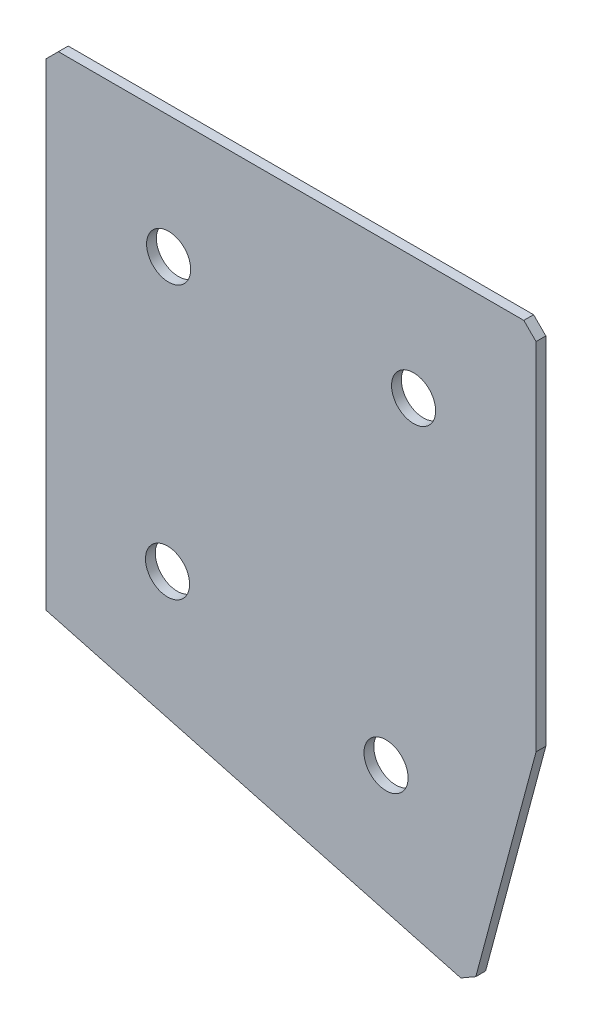
ISO-10303-21;
HEADER;
FILE_DESCRIPTION(('STEP AP214'),'2;1');
FILE_NAME('part.step','',(''),(''),'','','');
FILE_SCHEMA(('AUTOMOTIVE_DESIGN { 1 0 10303 214 1 1 1 1 }'));
ENDSEC;
DATA;
#1=APPLICATION_CONTEXT('core data for automotive mechanical design processes');
#2=APPLICATION_PROTOCOL_DEFINITION('international standard','automotive_design',2000,#1);
#3=PRODUCT_CONTEXT('',#1,'mechanical');
#4=PRODUCT('Part','Part','',(#3));
#5=PRODUCT_RELATED_PRODUCT_CATEGORY('part','',(#4));
#6=PRODUCT_DEFINITION_FORMATION('','',#4);
#7=PRODUCT_DEFINITION_CONTEXT('part definition',#1,'design');
#8=PRODUCT_DEFINITION('design','',#6,#7);
#9=PRODUCT_DEFINITION_SHAPE('','',#8);
#10=(LENGTH_UNIT() NAMED_UNIT(*) SI_UNIT(.MILLI.,.METRE.));
#11=(NAMED_UNIT(*) PLANE_ANGLE_UNIT() SI_UNIT($,.RADIAN.));
#12=(NAMED_UNIT(*) SI_UNIT($,.STERADIAN.) SOLID_ANGLE_UNIT());
#13=UNCERTAINTY_MEASURE_WITH_UNIT(LENGTH_MEASURE(1.E-05),#10,'distance_accuracy_value','');
#14=(GEOMETRIC_REPRESENTATION_CONTEXT(3) GLOBAL_UNCERTAINTY_ASSIGNED_CONTEXT((#13)) GLOBAL_UNIT_ASSIGNED_CONTEXT((#10,
#11,#12)) REPRESENTATION_CONTEXT('',''));
#15=CARTESIAN_POINT('',(0.,0.,0.));
#16=DIRECTION('',(0.,0.,1.));
#17=DIRECTION('',(1.,0.,0.));
#18=AXIS2_PLACEMENT_3D('',#15,#16,#17);
#19=CARTESIAN_POINT('',(0.,0.,-2.));
#20=DIRECTION('',(1.,0.,0.));
#21=DIRECTION('',(0.,0.,-1.));
#22=AXIS2_PLACEMENT_3D('',#19,#20,#21);
#23=PLANE('',#22);
#24=DIRECTION('',(0.,1.,0.));
#25=VECTOR('',#24,1.);
#26=CARTESIAN_POINT('',(0.,0.,0.));
#27=LINE('',#26,#25);
#28=CARTESIAN_POINT('',(0.,-100.,0.));
#29=VERTEX_POINT('',#28);
#30=CARTESIAN_POINT('',(0.,-2.5,0.));
#31=VERTEX_POINT('',#30);
#32=EDGE_CURVE('E137',#29,#31,#27,.T.);
#33=ORIENTED_EDGE('',*,*,#32,.T.);
#34=DIRECTION('',(0.,0.,-1.));
#35=VECTOR('',#34,1.);
#36=CARTESIAN_POINT('',(0.,-2.5,-2.));
#37=LINE('',#36,#35);
#38=CARTESIAN_POINT('',(0.,-2.5,-2.));
#39=VERTEX_POINT('',#38);
#40=EDGE_CURVE('E11',#31,#39,#37,.T.);
#41=ORIENTED_EDGE('',*,*,#40,.T.);
#42=DIRECTION('',(0.,1.,0.));
#43=VECTOR('',#42,1.);
#44=CARTESIAN_POINT('',(0.,0.,-2.));
#45=LINE('',#44,#43);
#46=CARTESIAN_POINT('',(0.,-100.,-2.));
#47=VERTEX_POINT('',#46);
#48=EDGE_CURVE('E153',#47,#39,#45,.T.);
#49=ORIENTED_EDGE('',*,*,#48,.F.);
#50=DIRECTION('',(0.,0.,1.));
#51=VECTOR('',#50,1.);
#52=CARTESIAN_POINT('',(0.,-100.,-2.));
#53=LINE('',#52,#51);
#54=EDGE_CURVE('E125',#47,#29,#53,.T.);
#55=ORIENTED_EDGE('',*,*,#54,.T.);
#56=EDGE_LOOP('',(#33,#41,#49,#55));
#57=FACE_BOUND('',#56,.T.);
#58=ADVANCED_FACE('F39',(#57),#23,.F.);
#59=CARTESIAN_POINT('',(0.,0.,-2.));
#60=DIRECTION('',(0.,-1.,0.));
#61=DIRECTION('',(0.,0.,-1.));
#62=AXIS2_PLACEMENT_3D('',#59,#60,#61);
#63=PLANE('',#62);
#64=DIRECTION('',(1.,0.,0.));
#65=VECTOR('',#64,1.);
#66=CARTESIAN_POINT('',(0.,0.,0.));
#67=LINE('',#66,#65);
#68=CARTESIAN_POINT('',(2.5,0.,0.));
#69=VERTEX_POINT('',#68);
#70=CARTESIAN_POINT('',(97.5,0.,0.));
#71=VERTEX_POINT('',#70);
#72=EDGE_CURVE('E141',#69,#71,#67,.T.);
#73=ORIENTED_EDGE('',*,*,#72,.T.);
#74=DIRECTION('',(0.,0.,-1.));
#75=VECTOR('',#74,1.);
#76=CARTESIAN_POINT('',(97.5,0.,-2.));
#77=LINE('',#76,#75);
#78=CARTESIAN_POINT('',(97.5,0.,-2.));
#79=VERTEX_POINT('',#78);
#80=EDGE_CURVE('E48',#71,#79,#77,.T.);
#81=ORIENTED_EDGE('',*,*,#80,.T.);
#82=DIRECTION('',(1.,0.,0.));
#83=VECTOR('',#82,1.);
#84=CARTESIAN_POINT('',(0.,0.,-2.));
#85=LINE('',#84,#83);
#86=CARTESIAN_POINT('',(2.5,0.,-2.));
#87=VERTEX_POINT('',#86);
#88=EDGE_CURVE('E113',#87,#79,#85,.T.);
#89=ORIENTED_EDGE('',*,*,#88,.F.);
#90=DIRECTION('',(0.,0.,1.));
#91=VECTOR('',#90,1.);
#92=CARTESIAN_POINT('',(2.5,0.,-2.));
#93=LINE('',#92,#91);
#94=EDGE_CURVE('E182',#87,#69,#93,.T.);
#95=ORIENTED_EDGE('',*,*,#94,.T.);
#96=EDGE_LOOP('',(#73,#81,#89,#95));
#97=FACE_BOUND('',#96,.T.);
#98=ADVANCED_FACE('F188',(#97),#63,.F.);
#99=CARTESIAN_POINT('',(100.,0.,-2.));
#100=DIRECTION('',(-1.,0.,0.));
#101=DIRECTION('',(0.,0.,1.));
#102=AXIS2_PLACEMENT_3D('',#99,#100,#101);
#103=PLANE('',#102);
#104=DIRECTION('',(0.,-1.,0.));
#105=VECTOR('',#104,1.);
#106=CARTESIAN_POINT('',(100.,0.,-2.));
#107=LINE('',#106,#105);
#108=CARTESIAN_POINT('',(100.,-2.50000000000003,-2.));
#109=VERTEX_POINT('',#108);
#110=CARTESIAN_POINT('',(100.,-75.0311102226082,-2.));
#111=VERTEX_POINT('',#110);
#112=EDGE_CURVE('E103',#109,#111,#107,.T.);
#113=ORIENTED_EDGE('',*,*,#112,.F.);
#114=DIRECTION('',(0.,0.,1.));
#115=VECTOR('',#114,1.);
#116=CARTESIAN_POINT('',(100.,-2.50000000000003,-2.));
#117=LINE('',#116,#115);
#118=CARTESIAN_POINT('',(100.,-2.50000000000003,0.));
#119=VERTEX_POINT('',#118);
#120=EDGE_CURVE('E179',#109,#119,#117,.T.);
#121=ORIENTED_EDGE('',*,*,#120,.T.);
#122=DIRECTION('',(0.,-1.,0.));
#123=VECTOR('',#122,1.);
#124=CARTESIAN_POINT('',(100.,0.,0.));
#125=LINE('',#124,#123);
#126=CARTESIAN_POINT('',(100.,-75.0311102226082,0.));
#127=VERTEX_POINT('',#126);
#128=EDGE_CURVE('E119',#119,#127,#125,.T.);
#129=ORIENTED_EDGE('',*,*,#128,.T.);
#130=DIRECTION('',(0.,0.,1.));
#131=VECTOR('',#130,1.);
#132=CARTESIAN_POINT('',(100.,-75.0311102226082,-2.));
#133=LINE('',#132,#131);
#134=EDGE_CURVE('E116',#111,#127,#133,.T.);
#135=ORIENTED_EDGE('',*,*,#134,.F.);
#136=EDGE_LOOP('',(#113,#121,#129,#135));
#137=FACE_BOUND('',#136,.T.);
#138=ADVANCED_FACE('F117',(#137),#103,.F.);
#139=CARTESIAN_POINT('',(87.0590477448739,-123.327401537062,-2.));
#140=DIRECTION('',(-0.965925826289068,0.258819045102521,0.));
#141=DIRECTION('',(-0.258819045102521,-0.965925826289068,0.));
#142=AXIS2_PLACEMENT_3D('',#139,#140,#141);
#143=PLANE('',#142);
#144=DIRECTION('',(-0.258819045102521,-0.965925826289068,0.));
#145=VECTOR('',#144,1.);
#146=CARTESIAN_POINT('',(87.0590477448739,-123.327401537062,0.));
#147=LINE('',#146,#145);
#148=CARTESIAN_POINT('',(87.7060953576302,-120.912586971339,0.));
#149=VERTEX_POINT('',#148);
#150=EDGE_CURVE('E147',#127,#149,#147,.T.);
#151=ORIENTED_EDGE('',*,*,#150,.T.);
#152=DIRECTION('',(0.,0.,-1.));
#153=VECTOR('',#152,1.);
#154=CARTESIAN_POINT('',(87.7060953576302,-120.912586971339,-2.));
#155=LINE('',#154,#153);
#156=CARTESIAN_POINT('',(87.7060953576302,-120.912586971339,-2.));
#157=VERTEX_POINT('',#156);
#158=EDGE_CURVE('E129',#149,#157,#155,.T.);
#159=ORIENTED_EDGE('',*,*,#158,.T.);
#160=DIRECTION('',(-0.258819045102521,-0.965925826289068,0.));
#161=VECTOR('',#160,1.);
#162=CARTESIAN_POINT('',(87.0590477448739,-123.327401537062,-2.));
#163=LINE('',#162,#161);
#164=EDGE_CURVE('E107',#111,#157,#163,.T.);
#165=ORIENTED_EDGE('',*,*,#164,.F.);
#166=ORIENTED_EDGE('',*,*,#134,.T.);
#167=EDGE_LOOP('',(#151,#159,#165,#166));
#168=FACE_BOUND('',#167,.T.);
#169=ADVANCED_FACE('F127',(#168),#143,.F.);
#170=CARTESIAN_POINT('',(0.,-100.,-2.));
#171=DIRECTION('',(0.258819045102521,0.965925826289068,0.));
#172=DIRECTION('',(-0.965925826289068,0.258819045102521,0.));
#173=AXIS2_PLACEMENT_3D('',#170,#171,#172);
#174=PLANE('',#173);
#175=DIRECTION('',(-0.965925826289068,0.258819045102521,0.));
#176=VECTOR('',#175,1.);
#177=CARTESIAN_POINT('',(0.,-100.,-2.));
#178=LINE('',#177,#176);
#179=CARTESIAN_POINT('',(84.6442331791512,-122.680353924305,-2.));
#180=VERTEX_POINT('',#179);
#181=EDGE_CURVE('E131',#180,#47,#178,.T.);
#182=ORIENTED_EDGE('',*,*,#181,.F.);
#183=DIRECTION('',(0.,0.,1.));
#184=VECTOR('',#183,1.);
#185=CARTESIAN_POINT('',(84.6442331791512,-122.680353924305,-2.));
#186=LINE('',#185,#184);
#187=CARTESIAN_POINT('',(84.6442331791512,-122.680353924305,0.));
#188=VERTEX_POINT('',#187);
#189=EDGE_CURVE('E124',#180,#188,#186,.T.);
#190=ORIENTED_EDGE('',*,*,#189,.T.);
#191=DIRECTION('',(-0.965925826289068,0.258819045102521,0.));
#192=VECTOR('',#191,1.);
#193=CARTESIAN_POINT('',(0.,-100.,0.));
#194=LINE('',#193,#192);
#195=EDGE_CURVE('E150',#188,#29,#194,.T.);
#196=ORIENTED_EDGE('',*,*,#195,.T.);
#197=ORIENTED_EDGE('',*,*,#54,.F.);
#198=EDGE_LOOP('',(#182,#190,#196,#197));
#199=FACE_BOUND('',#198,.T.);
#200=ADVANCED_FACE('F218',(#199),#174,.F.);
#201=CARTESIAN_POINT('',(0.,0.,-2.));
#202=DIRECTION('',(0.,0.,1.));
#203=DIRECTION('',(1.,0.,0.));
#204=AXIS2_PLACEMENT_3D('',#201,#202,#203);
#205=PLANE('',#204);
#206=CARTESIAN_POINT('',(24.7762464008849,-80.7568707043396,-2.));
#207=DIRECTION('',(0.,0.,-1.));
#208=DIRECTION('',(0.,1.,0.));
#209=AXIS2_PLACEMENT_3D('',#206,#207,#208);
#210=CIRCLE('',#209,4.5);
#211=CARTESIAN_POINT('',(24.7762464008849,-76.2568707043396,-2.));
#212=VERTEX_POINT('',#211);
#213=EDGE_CURVE('E250',#212,#212,#210,.T.);
#214=ORIENTED_EDGE('',*,*,#213,.F.);
#215=EDGE_LOOP('',(#214));
#216=FACE_BOUND('',#215,.T.);
#217=CARTESIAN_POINT('',(69.3813782152103,-92.7087797522719,-2.00000000000001));
#218=DIRECTION('',(0.,0.,-1.));
#219=DIRECTION('',(0.,1.,0.));
#220=AXIS2_PLACEMENT_3D('',#217,#218,#219);
#221=CIRCLE('',#220,4.5);
#222=CARTESIAN_POINT('',(69.3813782152103,-88.2087797522719,-2.00000000000001));
#223=VERTEX_POINT('',#222);
#224=EDGE_CURVE('E254',#223,#223,#221,.T.);
#225=ORIENTED_EDGE('',*,*,#224,.F.);
#226=EDGE_LOOP('',(#225));
#227=FACE_BOUND('',#226,.T.);
#228=CARTESIAN_POINT('',(25.,-25.,-2.));
#229=DIRECTION('',(0.,0.,-1.));
#230=DIRECTION('',(0.,1.,0.));
#231=AXIS2_PLACEMENT_3D('',#228,#229,#230);
#232=CIRCLE('',#231,4.5);
#233=CARTESIAN_POINT('',(25.,-20.5,-2.));
#234=VERTEX_POINT('',#233);
#235=EDGE_CURVE('E264',#234,#234,#232,.T.);
#236=ORIENTED_EDGE('',*,*,#235,.F.);
#237=EDGE_LOOP('',(#236));
#238=FACE_BOUND('',#237,.T.);
#239=CARTESIAN_POINT('',(75.,-25.,-2.));
#240=DIRECTION('',(0.,0.,-1.));
#241=DIRECTION('',(0.,1.,0.));
#242=AXIS2_PLACEMENT_3D('',#239,#240,#241);
#243=CIRCLE('',#242,4.5);
#244=CARTESIAN_POINT('',(75.,-20.5,-2.));
#245=VERTEX_POINT('',#244);
#246=EDGE_CURVE('E272',#245,#245,#243,.T.);
#247=ORIENTED_EDGE('',*,*,#246,.F.);
#248=EDGE_LOOP('',(#247));
#249=FACE_BOUND('',#248,.T.);
#250=ORIENTED_EDGE('',*,*,#164,.T.);
#251=DIRECTION('',(0.866025403784439,0.5,0.));
#252=VECTOR('',#251,1.);
#253=CARTESIAN_POINT('',(84.6442331791512,-122.680353924305,-2.));
#254=LINE('',#253,#252);
#255=EDGE_CURVE('E176',#157,#180,#254,.F.);
#256=ORIENTED_EDGE('',*,*,#255,.T.);
#257=ORIENTED_EDGE('',*,*,#181,.T.);
#258=ORIENTED_EDGE('',*,*,#48,.T.);
#259=DIRECTION('',(-0.707106781186548,-0.707106781186548,0.));
#260=VECTOR('',#259,1.);
#261=CARTESIAN_POINT('',(2.5,0.,-2.));
#262=LINE('',#261,#260);
#263=EDGE_CURVE('E171',#39,#87,#262,.F.);
#264=ORIENTED_EDGE('',*,*,#263,.T.);
#265=ORIENTED_EDGE('',*,*,#88,.T.);
#266=DIRECTION('',(-0.707106781186548,0.707106781186548,0.));
#267=VECTOR('',#266,1.);
#268=CARTESIAN_POINT('',(100.,-2.50000000000003,-2.));
#269=LINE('',#268,#267);
#270=EDGE_CURVE('E55',#79,#109,#269,.F.);
#271=ORIENTED_EDGE('',*,*,#270,.T.);
#272=ORIENTED_EDGE('',*,*,#112,.T.);
#273=EDGE_LOOP('',(#250,#256,#257,#258,#264,#265,#271,#272));
#274=FACE_BOUND('',#273,.T.);
#275=ADVANCED_FACE('F105',(#216,#227,#238,#249,#274),#205,.F.);
#276=CARTESIAN_POINT('',(0.,0.,0.));
#277=DIRECTION('',(0.,0.,1.));
#278=DIRECTION('',(1.,0.,0.));
#279=AXIS2_PLACEMENT_3D('',#276,#277,#278);
#280=PLANE('',#279);
#281=CARTESIAN_POINT('',(24.7762464008849,-80.7568707043396,0.));
#282=DIRECTION('',(0.,0.,-1.));
#283=DIRECTION('',(0.,1.,0.));
#284=AXIS2_PLACEMENT_3D('',#281,#282,#283);
#285=CIRCLE('',#284,4.5);
#286=CARTESIAN_POINT('',(24.7762464008849,-76.2568707043396,0.));
#287=VERTEX_POINT('',#286);
#288=EDGE_CURVE('E247',#287,#287,#285,.T.);
#289=ORIENTED_EDGE('',*,*,#288,.T.);
#290=EDGE_LOOP('',(#289));
#291=FACE_BOUND('',#290,.T.);
#292=CARTESIAN_POINT('',(69.3813782152103,-92.7087797522719,0.));
#293=DIRECTION('',(0.,0.,-1.));
#294=DIRECTION('',(0.,1.,0.));
#295=AXIS2_PLACEMENT_3D('',#292,#293,#294);
#296=CIRCLE('',#295,4.5);
#297=CARTESIAN_POINT('',(69.3813782152103,-88.2087797522719,0.));
#298=VERTEX_POINT('',#297);
#299=EDGE_CURVE('E260',#298,#298,#296,.T.);
#300=ORIENTED_EDGE('',*,*,#299,.T.);
#301=EDGE_LOOP('',(#300));
#302=FACE_BOUND('',#301,.T.);
#303=CARTESIAN_POINT('',(25.,-25.,0.));
#304=DIRECTION('',(0.,0.,-1.));
#305=DIRECTION('',(0.,1.,0.));
#306=AXIS2_PLACEMENT_3D('',#303,#304,#305);
#307=CIRCLE('',#306,4.5);
#308=CARTESIAN_POINT('',(25.,-20.5,0.));
#309=VERTEX_POINT('',#308);
#310=EDGE_CURVE('E268',#309,#309,#307,.T.);
#311=ORIENTED_EDGE('',*,*,#310,.T.);
#312=EDGE_LOOP('',(#311));
#313=FACE_BOUND('',#312,.T.);
#314=CARTESIAN_POINT('',(75.,-25.,0.));
#315=DIRECTION('',(0.,0.,-1.));
#316=DIRECTION('',(0.,1.,0.));
#317=AXIS2_PLACEMENT_3D('',#314,#315,#316);
#318=CIRCLE('',#317,4.5);
#319=CARTESIAN_POINT('',(75.,-20.5,0.));
#320=VERTEX_POINT('',#319);
#321=EDGE_CURVE('E142',#320,#320,#318,.T.);
#322=ORIENTED_EDGE('',*,*,#321,.T.);
#323=EDGE_LOOP('',(#322));
#324=FACE_BOUND('',#323,.T.);
#325=ORIENTED_EDGE('',*,*,#195,.F.);
#326=DIRECTION('',(-0.866025403784439,-0.5,0.));
#327=VECTOR('',#326,1.);
#328=CARTESIAN_POINT('',(74.283209816645,-128.662293551728,0.));
#329=LINE('',#328,#327);
#330=EDGE_CURVE('E166',#188,#149,#329,.F.);
#331=ORIENTED_EDGE('',*,*,#330,.T.);
#332=ORIENTED_EDGE('',*,*,#150,.F.);
#333=ORIENTED_EDGE('',*,*,#128,.F.);
#334=DIRECTION('',(0.707106781186548,-0.707106781186548,0.));
#335=VECTOR('',#334,1.);
#336=CARTESIAN_POINT('',(48.75,48.75,0.));
#337=LINE('',#336,#335);
#338=EDGE_CURVE('E163',#119,#71,#337,.F.);
#339=ORIENTED_EDGE('',*,*,#338,.T.);
#340=ORIENTED_EDGE('',*,*,#72,.F.);
#341=DIRECTION('',(0.707106781186548,0.707106781186548,0.));
#342=VECTOR('',#341,1.);
#343=CARTESIAN_POINT('',(1.25,-1.25,0.));
#344=LINE('',#343,#342);
#345=EDGE_CURVE('E160',#69,#31,#344,.F.);
#346=ORIENTED_EDGE('',*,*,#345,.T.);
#347=ORIENTED_EDGE('',*,*,#32,.F.);
#348=EDGE_LOOP('',(#325,#331,#332,#333,#339,#340,#346,#347));
#349=FACE_BOUND('',#348,.T.);
#350=ADVANCED_FACE('F193',(#291,#302,#313,#324,#349),#280,.T.);
#351=CARTESIAN_POINT('',(75.,-25.,-2.));
#352=DIRECTION('',(0.,0.,-1.));
#353=DIRECTION('',(0.,1.,0.));
#354=AXIS2_PLACEMENT_3D('',#351,#352,#353);
#355=CYLINDRICAL_SURFACE('',#354,4.5);
#356=ORIENTED_EDGE('',*,*,#321,.F.);
#357=EDGE_LOOP('',(#356));
#358=FACE_BOUND('',#357,.T.);
#359=ORIENTED_EDGE('',*,*,#246,.T.);
#360=EDGE_LOOP('',(#359));
#361=FACE_BOUND('',#360,.T.);
#362=ADVANCED_FACE('F224',(#358,#361),#355,.F.);
#363=CARTESIAN_POINT('',(25.,-25.,-2.));
#364=DIRECTION('',(0.,0.,-1.));
#365=DIRECTION('',(0.,1.,0.));
#366=AXIS2_PLACEMENT_3D('',#363,#364,#365);
#367=CYLINDRICAL_SURFACE('',#366,4.5);
#368=ORIENTED_EDGE('',*,*,#310,.F.);
#369=EDGE_LOOP('',(#368));
#370=FACE_BOUND('',#369,.T.);
#371=ORIENTED_EDGE('',*,*,#235,.T.);
#372=EDGE_LOOP('',(#371));
#373=FACE_BOUND('',#372,.T.);
#374=ADVANCED_FACE('F231',(#370,#373),#367,.F.);
#375=CARTESIAN_POINT('',(69.3813782152103,-92.7087797522719,-2.00000000000001));
#376=DIRECTION('',(0.,0.,-1.));
#377=DIRECTION('',(0.,1.,0.));
#378=AXIS2_PLACEMENT_3D('',#375,#376,#377);
#379=CYLINDRICAL_SURFACE('',#378,4.5);
#380=ORIENTED_EDGE('',*,*,#299,.F.);
#381=EDGE_LOOP('',(#380));
#382=FACE_BOUND('',#381,.T.);
#383=ORIENTED_EDGE('',*,*,#224,.T.);
#384=EDGE_LOOP('',(#383));
#385=FACE_BOUND('',#384,.T.);
#386=ADVANCED_FACE('F235',(#382,#385),#379,.F.);
#387=CARTESIAN_POINT('',(24.7762464008849,-80.7568707043396,-2.));
#388=DIRECTION('',(0.,0.,-1.));
#389=DIRECTION('',(0.,1.,0.));
#390=AXIS2_PLACEMENT_3D('',#387,#388,#389);
#391=CYLINDRICAL_SURFACE('',#390,4.5);
#392=ORIENTED_EDGE('',*,*,#288,.F.);
#393=EDGE_LOOP('',(#392));
#394=FACE_BOUND('',#393,.T.);
#395=ORIENTED_EDGE('',*,*,#213,.T.);
#396=EDGE_LOOP('',(#395));
#397=FACE_BOUND('',#396,.T.);
#398=ADVANCED_FACE('F203',(#394,#397),#391,.F.);
#399=CARTESIAN_POINT('',(84.6442331791512,-122.680353924305,-2.));
#400=DIRECTION('',(-0.5,0.866025403784439,0.));
#401=DIRECTION('',(0.,0.,1.));
#402=AXIS2_PLACEMENT_3D('',#399,#400,#401);
#403=PLANE('',#402);
#404=ORIENTED_EDGE('',*,*,#255,.F.);
#405=ORIENTED_EDGE('',*,*,#158,.F.);
#406=ORIENTED_EDGE('',*,*,#330,.F.);
#407=ORIENTED_EDGE('',*,*,#189,.F.);
#408=EDGE_LOOP('',(#404,#405,#406,#407));
#409=FACE_BOUND('',#408,.T.);
#410=ADVANCED_FACE('F198',(#409),#403,.F.);
#411=CARTESIAN_POINT('',(100.,-2.50000000000003,-2.));
#412=DIRECTION('',(-0.707106781186547,-0.707106781186547,0.));
#413=DIRECTION('',(0.,0.,1.));
#414=AXIS2_PLACEMENT_3D('',#411,#412,#413);
#415=PLANE('',#414);
#416=ORIENTED_EDGE('',*,*,#270,.F.);
#417=ORIENTED_EDGE('',*,*,#80,.F.);
#418=ORIENTED_EDGE('',*,*,#338,.F.);
#419=ORIENTED_EDGE('',*,*,#120,.F.);
#420=EDGE_LOOP('',(#416,#417,#418,#419));
#421=FACE_BOUND('',#420,.T.);
#422=ADVANCED_FACE('F196',(#421),#415,.F.);
#423=CARTESIAN_POINT('',(2.5,0.,-2.));
#424=DIRECTION('',(0.707106781186547,-0.707106781186547,0.));
#425=DIRECTION('',(0.,0.,1.));
#426=AXIS2_PLACEMENT_3D('',#423,#424,#425);
#427=PLANE('',#426);
#428=ORIENTED_EDGE('',*,*,#263,.F.);
#429=ORIENTED_EDGE('',*,*,#40,.F.);
#430=ORIENTED_EDGE('',*,*,#345,.F.);
#431=ORIENTED_EDGE('',*,*,#94,.F.);
#432=EDGE_LOOP('',(#428,#429,#430,#431));
#433=FACE_BOUND('',#432,.T.);
#434=ADVANCED_FACE('F41',(#433),#427,.F.);
#435=CLOSED_SHELL('',(#58,#98,#138,#169,#200,#275,#350,#362,#374,#386,#398,#410,#422,#434));
#436=MANIFOLD_SOLID_BREP('B2',#435);
#437=ADVANCED_BREP_SHAPE_REPRESENTATION('',(#18,#436),#14);
#438=SHAPE_DEFINITION_REPRESENTATION(#9,#437);
ENDSEC;
END-ISO-10303-21;
